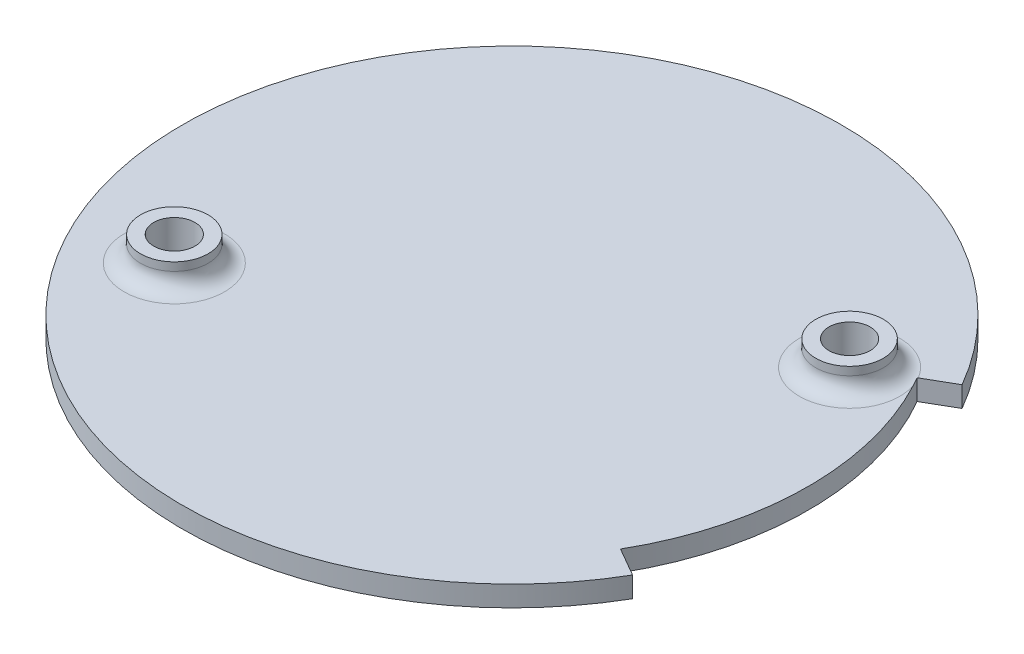
ISO-10303-21;
HEADER;
FILE_DESCRIPTION(('STEP AP214'),'2;1');
FILE_NAME('part.step','',(''),(''),'','','');
FILE_SCHEMA(('AUTOMOTIVE_DESIGN { 1 0 10303 214 1 1 1 1 }'));
ENDSEC;
DATA;
#1=APPLICATION_CONTEXT('core data for automotive mechanical design processes');
#2=APPLICATION_PROTOCOL_DEFINITION('international standard','automotive_design',2000,#1);
#3=PRODUCT_CONTEXT('',#1,'mechanical');
#4=PRODUCT('Part','Part','',(#3));
#5=PRODUCT_RELATED_PRODUCT_CATEGORY('part','',(#4));
#6=PRODUCT_DEFINITION_FORMATION('','',#4);
#7=PRODUCT_DEFINITION_CONTEXT('part definition',#1,'design');
#8=PRODUCT_DEFINITION('design','',#6,#7);
#9=PRODUCT_DEFINITION_SHAPE('','',#8);
#10=(LENGTH_UNIT() NAMED_UNIT(*) SI_UNIT(.MILLI.,.METRE.));
#11=(NAMED_UNIT(*) PLANE_ANGLE_UNIT() SI_UNIT($,.RADIAN.));
#12=(NAMED_UNIT(*) SI_UNIT($,.STERADIAN.) SOLID_ANGLE_UNIT());
#13=UNCERTAINTY_MEASURE_WITH_UNIT(LENGTH_MEASURE(1.E-05),#10,'distance_accuracy_value','');
#14=(GEOMETRIC_REPRESENTATION_CONTEXT(3) GLOBAL_UNCERTAINTY_ASSIGNED_CONTEXT((#13)) GLOBAL_UNIT_ASSIGNED_CONTEXT((#10,
#11,#12)) REPRESENTATION_CONTEXT('',''));
#15=CARTESIAN_POINT('',(0.,0.,0.));
#16=DIRECTION('',(0.,0.,1.));
#17=DIRECTION('',(1.,0.,0.));
#18=AXIS2_PLACEMENT_3D('',#15,#16,#17);
#19=CARTESIAN_POINT('',(0.,15.875,0.));
#20=DIRECTION('',(0.,1.,0.));
#21=DIRECTION('',(0.,0.,1.));
#22=AXIS2_PLACEMENT_3D('',#19,#20,#21);
#23=PLANE('',#22);
#24=CARTESIAN_POINT('',(-32.9955678841872,15.875,19.0499999999999));
#25=DIRECTION('',(0.,-1.,0.));
#26=DIRECTION('',(0.,0.,-1.));
#27=AXIS2_PLACEMENT_3D('',#24,#25,#26);
#28=CIRCLE('',#27,1.65);
#29=CARTESIAN_POINT('',(-32.9955678841872,15.875,17.3999999999999));
#30=VERTEX_POINT('',#29);
#31=EDGE_CURVE('E263',#30,#30,#28,.T.);
#32=ORIENTED_EDGE('',*,*,#31,.F.);
#33=EDGE_LOOP('',(#32));
#34=FACE_BOUND('',#33,.T.);
#35=CARTESIAN_POINT('',(32.9955678841872,15.875,-19.0499999999999));
#36=DIRECTION('',(0.,-1.,0.));
#37=DIRECTION('',(0.,0.,-1.));
#38=AXIS2_PLACEMENT_3D('',#35,#36,#37);
#39=CIRCLE('',#38,1.65);
#40=CARTESIAN_POINT('',(32.9955678841872,15.875,-20.6999999999999));
#41=VERTEX_POINT('',#40);
#42=EDGE_CURVE('E260',#41,#41,#39,.T.);
#43=ORIENTED_EDGE('',*,*,#42,.F.);
#44=EDGE_LOOP('',(#43));
#45=FACE_BOUND('',#44,.T.);
#46=DIRECTION('',(-0.866025403784438,0.,0.500000000000001));
#47=VECTOR('',#46,1.);
#48=CARTESIAN_POINT('',(0.,15.875,0.));
#49=LINE('',#48,#47);
#50=CARTESIAN_POINT('',(43.9940905122494,15.875,-25.4000000000001));
#51=VERTEX_POINT('',#50);
#52=CARTESIAN_POINT('',(39.5946814610245,15.875,-22.86));
#53=VERTEX_POINT('',#52);
#54=EDGE_CURVE('E98',#51,#53,#49,.T.);
#55=ORIENTED_EDGE('',*,*,#54,.T.);
#56=CARTESIAN_POINT('',(0.,15.875,0.));
#57=DIRECTION('',(0.,1.,0.));
#58=DIRECTION('',(0.,0.,1.));
#59=AXIS2_PLACEMENT_3D('',#56,#57,#58);
#60=CIRCLE('',#59,45.72);
#61=CARTESIAN_POINT('',(39.5946814610245,15.875,22.86));
#62=VERTEX_POINT('',#61);
#63=EDGE_CURVE('E99',#53,#62,#60,.F.);
#64=ORIENTED_EDGE('',*,*,#63,.T.);
#65=DIRECTION('',(-0.866025403784438,0.,-0.500000000000001));
#66=VECTOR('',#65,1.);
#67=CARTESIAN_POINT('',(0.,15.875,0.));
#68=LINE('',#67,#66);
#69=CARTESIAN_POINT('',(43.9940905122494,15.875,25.4000000000001));
#70=VERTEX_POINT('',#69);
#71=EDGE_CURVE('E112',#70,#62,#68,.T.);
#72=ORIENTED_EDGE('',*,*,#71,.F.);
#73=CARTESIAN_POINT('',(0.,15.875,0.));
#74=DIRECTION('',(0.,1.,0.));
#75=DIRECTION('',(0.,0.,1.));
#76=AXIS2_PLACEMENT_3D('',#73,#74,#75);
#77=CIRCLE('',#76,50.8);
#78=EDGE_CURVE('E102',#51,#70,#77,.T.);
#79=ORIENTED_EDGE('',*,*,#78,.F.);
#80=EDGE_LOOP('',(#55,#64,#72,#79));
#81=FACE_BOUND('',#80,.T.);
#82=ADVANCED_FACE('F47',(#34,#45,#81),#23,.F.);
#83=CARTESIAN_POINT('',(0.,3.175,0.));
#84=DIRECTION('',(0.,-1.,0.));
#85=DIRECTION('',(0.,0.,-1.));
#86=AXIS2_PLACEMENT_3D('',#83,#84,#85);
#87=CYLINDRICAL_SURFACE('',#86,50.8);
#88=DIRECTION('',(0.,1.,0.));
#89=VECTOR('',#88,1.);
#90=CARTESIAN_POINT('',(43.9940905122494,0.,-25.4000000000001));
#91=LINE('',#90,#89);
#92=CARTESIAN_POINT('',(43.9940905122494,19.05,-25.4000000000001));
#93=VERTEX_POINT('',#92);
#94=EDGE_CURVE('E116',#51,#93,#91,.T.);
#95=ORIENTED_EDGE('',*,*,#94,.F.);
#96=ORIENTED_EDGE('',*,*,#78,.T.);
#97=DIRECTION('',(0.,1.,0.));
#98=VECTOR('',#97,1.);
#99=CARTESIAN_POINT('',(43.9940905122494,0.,25.4000000000001));
#100=LINE('',#99,#98);
#101=CARTESIAN_POINT('',(43.9940905122494,19.05,25.4000000000001));
#102=VERTEX_POINT('',#101);
#103=EDGE_CURVE('E120',#70,#102,#100,.T.);
#104=ORIENTED_EDGE('',*,*,#103,.T.);
#105=CARTESIAN_POINT('',(0.,19.05,0.));
#106=DIRECTION('',(0.,1.,0.));
#107=DIRECTION('',(0.,0.,1.));
#108=AXIS2_PLACEMENT_3D('',#105,#106,#107);
#109=CIRCLE('',#108,50.8);
#110=EDGE_CURVE('E186',#93,#102,#109,.T.);
#111=ORIENTED_EDGE('',*,*,#110,.F.);
#112=EDGE_LOOP('',(#95,#96,#104,#111));
#113=FACE_BOUND('',#112,.T.);
#114=ADVANCED_FACE('F154',(#113),#87,.T.);
#115=CARTESIAN_POINT('',(0.,0.,0.));
#116=DIRECTION('',(-0.500000000000001,0.,0.866025403784438));
#117=DIRECTION('',(0.866025403784438,0.,0.500000000000001));
#118=AXIS2_PLACEMENT_3D('',#115,#116,#117);
#119=PLANE('',#118);
#120=ORIENTED_EDGE('',*,*,#103,.F.);
#121=ORIENTED_EDGE('',*,*,#71,.T.);
#122=DIRECTION('',(0.,1.,0.));
#123=VECTOR('',#122,1.);
#124=CARTESIAN_POINT('',(39.5946814610245,0.,22.86));
#125=LINE('',#124,#123);
#126=CARTESIAN_POINT('',(39.5946814610245,19.05,22.86));
#127=VERTEX_POINT('',#126);
#128=EDGE_CURVE('E111',#62,#127,#125,.T.);
#129=ORIENTED_EDGE('',*,*,#128,.T.);
#130=DIRECTION('',(-0.866025403784438,0.,-0.500000000000001));
#131=VECTOR('',#130,1.);
#132=CARTESIAN_POINT('',(0.,19.05,0.));
#133=LINE('',#132,#131);
#134=EDGE_CURVE('E183',#102,#127,#133,.T.);
#135=ORIENTED_EDGE('',*,*,#134,.F.);
#136=EDGE_LOOP('',(#120,#121,#129,#135));
#137=FACE_BOUND('',#136,.T.);
#138=ADVANCED_FACE('F161',(#137),#119,.F.);
#139=CARTESIAN_POINT('',(0.,0.,0.));
#140=DIRECTION('',(0.,1.,0.));
#141=DIRECTION('',(0.,0.,1.));
#142=AXIS2_PLACEMENT_3D('',#139,#140,#141);
#143=CYLINDRICAL_SURFACE('',#142,45.72);
#144=ORIENTED_EDGE('',*,*,#63,.F.);
#145=DIRECTION('',(0.,1.,0.));
#146=VECTOR('',#145,1.);
#147=CARTESIAN_POINT('',(39.5946814610245,0.,-22.8600000000001));
#148=LINE('',#147,#146);
#149=CARTESIAN_POINT('',(39.5946814610245,19.0531769868593,-22.8600000000001));
#150=VERTEX_POINT('',#149);
#151=EDGE_CURVE('E66',#53,#150,#148,.T.);
#152=ORIENTED_EDGE('',*,*,#151,.T.);
#153=CARTESIAN_POINT('',(39.5946814610245,19.0531769868593,-22.8600000000001));
#154=CARTESIAN_POINT('',(39.6584509865653,19.0531940198967,-22.7495479663954));
#155=CARTESIAN_POINT('',(39.7217581950967,19.0530434085188,-22.6388293044365));
#156=CARTESIAN_POINT('',(39.8474392470708,19.0525347988836,-22.4168742014402));
#157=CARTESIAN_POINT('',(39.9098131557882,19.0521768152002,-22.3056377973336));
#158=CARTESIAN_POINT('',(40.0336277838406,19.0513813297176,-22.0826472645168));
#159=CARTESIAN_POINT('',(40.0950685040283,19.0509438279912,-21.9708931362797));
#160=CARTESIAN_POINT('',(40.2170171736378,19.0502604060662,-21.746866345461));
#161=CARTESIAN_POINT('',(40.277525056747,19.0500144994265,-21.6345936467463));
#162=CARTESIAN_POINT('',(40.3375623533858,19.05,-21.5220692171247));
#163=B_SPLINE_CURVE_WITH_KNOTS('',3,(#153,#154,#155,#156,#157,#158,#159,#160,#161,#162),
.UNSPECIFIED.,.F.,.F.,(4,2,2,2,4),(0.,0.382615476870098,0.765204067465549,1.14779230850627,
1.53040762235897),.UNSPECIFIED.);
#164=CARTESIAN_POINT('',(40.3375623533858,19.05,-21.5220692171247));
#165=VERTEX_POINT('',#164);
#166=EDGE_CURVE('E11',#150,#165,#163,.T.);
#167=ORIENTED_EDGE('',*,*,#166,.T.);
#168=CARTESIAN_POINT('',(0.,19.05,0.));
#169=DIRECTION('',(0.,1.,0.));
#170=DIRECTION('',(0.,0.,1.));
#171=AXIS2_PLACEMENT_3D('',#168,#169,#170);
#172=CIRCLE('',#171,45.72);
#173=EDGE_CURVE('E192',#127,#165,#172,.T.);
#174=ORIENTED_EDGE('',*,*,#173,.F.);
#175=ORIENTED_EDGE('',*,*,#128,.F.);
#176=EDGE_LOOP('',(#144,#152,#167,#174,#175));
#177=FACE_BOUND('',#176,.T.);
#178=ADVANCED_FACE('F109',(#177),#143,.T.);
#179=CARTESIAN_POINT('',(0.,0.,0.));
#180=DIRECTION('',(0.500000000000001,0.,0.866025403784438));
#181=DIRECTION('',(0.866025403784438,0.,-0.500000000000001));
#182=AXIS2_PLACEMENT_3D('',#179,#180,#181);
#183=PLANE('',#182);
#184=ORIENTED_EDGE('',*,*,#54,.F.);
#185=ORIENTED_EDGE('',*,*,#94,.T.);
#186=DIRECTION('',(0.866025403784438,0.,-0.500000000000001));
#187=VECTOR('',#186,1.);
#188=CARTESIAN_POINT('',(0.,19.05,0.));
#189=LINE('',#188,#187);
#190=CARTESIAN_POINT('',(39.7046666873051,19.05,-22.9235000000001));
#191=VERTEX_POINT('',#190);
#192=EDGE_CURVE('E125',#191,#93,#189,.T.);
#193=ORIENTED_EDGE('',*,*,#192,.F.);
#194=CARTESIAN_POINT('',(39.7046666873052,21.59,-22.9234999999999));
#195=DIRECTION('',(0.500000000000001,0.,0.866025403784438));
#196=DIRECTION('',(0.866025403784438,0.,-0.500000000000001));
#197=AXIS2_PLACEMENT_3D('',#194,#195,#196);
#198=CIRCLE('',#197,2.54);
#199=EDGE_CURVE('E60',#191,#150,#198,.F.);
#200=ORIENTED_EDGE('',*,*,#199,.T.);
#201=ORIENTED_EDGE('',*,*,#151,.F.);
#202=EDGE_LOOP('',(#184,#185,#193,#200,#201));
#203=FACE_BOUND('',#202,.T.);
#204=ADVANCED_FACE('F114',(#203),#183,.T.);
#205=CARTESIAN_POINT('',(0.,19.05,0.));
#206=DIRECTION('',(0.,1.,0.));
#207=DIRECTION('',(0.,0.,1.));
#208=AXIS2_PLACEMENT_3D('',#205,#206,#207);
#209=PLANE('',#208);
#210=CARTESIAN_POINT('',(-32.9955678841872,19.05,19.0499999999999));
#211=DIRECTION('',(0.,1.,0.));
#212=DIRECTION('',(0.,0.,1.));
#213=AXIS2_PLACEMENT_3D('',#210,#211,#212);
#214=CIRCLE('',#213,7.747);
#215=CARTESIAN_POINT('',(-32.9955678841872,19.05,26.7969999999999));
#216=VERTEX_POINT('',#215);
#217=EDGE_CURVE('E128',#216,#216,#214,.F.);
#218=ORIENTED_EDGE('',*,*,#217,.T.);
#219=EDGE_LOOP('',(#218));
#220=FACE_BOUND('',#219,.T.);
#221=ORIENTED_EDGE('',*,*,#173,.T.);
#222=CARTESIAN_POINT('',(32.9955678841872,19.05,-19.0499999999999));
#223=DIRECTION('',(0.,1.,0.));
#224=DIRECTION('',(0.,0.,1.));
#225=AXIS2_PLACEMENT_3D('',#222,#223,#224);
#226=CIRCLE('',#225,7.747);
#227=EDGE_CURVE('E131',#165,#191,#226,.F.);
#228=ORIENTED_EDGE('',*,*,#227,.T.);
#229=ORIENTED_EDGE('',*,*,#192,.T.);
#230=ORIENTED_EDGE('',*,*,#110,.T.);
#231=ORIENTED_EDGE('',*,*,#134,.T.);
#232=EDGE_LOOP('',(#221,#228,#229,#230,#231));
#233=FACE_BOUND('',#232,.T.);
#234=ADVANCED_FACE('F167',(#220,#233),#209,.T.);
#235=CARTESIAN_POINT('',(32.9955678841872,17.78,-19.0499999999999));
#236=DIRECTION('',(0.,1.,0.));
#237=DIRECTION('',(0.,0.,1.));
#238=AXIS2_PLACEMENT_3D('',#235,#236,#237);
#239=PLANE('',#238);
#240=CARTESIAN_POINT('',(32.9955678841872,17.78,-19.0499999999999));
#241=DIRECTION('',(0.,1.,0.));
#242=DIRECTION('',(0.,0.,1.));
#243=AXIS2_PLACEMENT_3D('',#240,#241,#242);
#244=CIRCLE('',#243,1.65);
#245=CARTESIAN_POINT('',(32.9955678841872,17.78,-17.3999999999999));
#246=VERTEX_POINT('',#245);
#247=EDGE_CURVE('E258',#246,#246,#244,.F.);
#248=ORIENTED_EDGE('',*,*,#247,.T.);
#249=EDGE_LOOP('',(#248));
#250=FACE_BOUND('',#249,.T.);
#251=CARTESIAN_POINT('',(32.9955678841872,17.78,-19.0499999999999));
#252=DIRECTION('',(0.,1.,0.));
#253=DIRECTION('',(0.,0.,1.));
#254=AXIS2_PLACEMENT_3D('',#251,#252,#253);
#255=CIRCLE('',#254,3.175);
#256=CARTESIAN_POINT('',(32.9955678841872,17.78,-15.8749999999999));
#257=VERTEX_POINT('',#256);
#258=EDGE_CURVE('E220',#257,#257,#255,.T.);
#259=ORIENTED_EDGE('',*,*,#258,.T.);
#260=EDGE_LOOP('',(#259));
#261=FACE_BOUND('',#260,.T.);
#262=ADVANCED_FACE('F226',(#250,#261),#239,.T.);
#263=CARTESIAN_POINT('',(32.9955678841872,17.78,-19.0499999999999));
#264=DIRECTION('',(0.,1.,0.));
#265=DIRECTION('',(0.,0.,1.));
#266=AXIS2_PLACEMENT_3D('',#263,#264,#265);
#267=CYLINDRICAL_SURFACE('',#266,3.175);
#268=ORIENTED_EDGE('',*,*,#258,.F.);
#269=EDGE_LOOP('',(#268));
#270=FACE_BOUND('',#269,.T.);
#271=CARTESIAN_POINT('',(32.9955678841872,22.86,-19.0499999999999));
#272=DIRECTION('',(0.,1.,0.));
#273=DIRECTION('',(0.,0.,1.));
#274=AXIS2_PLACEMENT_3D('',#271,#272,#273);
#275=CIRCLE('',#274,3.175);
#276=CARTESIAN_POINT('',(32.9955678841872,22.86,-15.8749999999999));
#277=VERTEX_POINT('',#276);
#278=EDGE_CURVE('E208',#277,#277,#275,.F.);
#279=ORIENTED_EDGE('',*,*,#278,.F.);
#280=EDGE_LOOP('',(#279));
#281=FACE_BOUND('',#280,.T.);
#282=ADVANCED_FACE('F228',(#270,#281),#267,.F.);
#283=CARTESIAN_POINT('',(-32.9955678841872,17.78,19.0499999999999));
#284=DIRECTION('',(0.,1.,0.));
#285=DIRECTION('',(0.,0.,1.));
#286=AXIS2_PLACEMENT_3D('',#283,#284,#285);
#287=PLANE('',#286);
#288=CARTESIAN_POINT('',(-32.9955678841872,17.78,19.0499999999999));
#289=DIRECTION('',(0.,1.,0.));
#290=DIRECTION('',(0.,0.,1.));
#291=AXIS2_PLACEMENT_3D('',#288,#289,#290);
#292=CIRCLE('',#291,1.65);
#293=CARTESIAN_POINT('',(-32.9955678841872,17.78,20.6999999999999));
#294=VERTEX_POINT('',#293);
#295=EDGE_CURVE('E214',#294,#294,#292,.F.);
#296=ORIENTED_EDGE('',*,*,#295,.T.);
#297=EDGE_LOOP('',(#296));
#298=FACE_BOUND('',#297,.T.);
#299=CARTESIAN_POINT('',(-32.9955678841872,17.78,19.0499999999999));
#300=DIRECTION('',(0.,1.,0.));
#301=DIRECTION('',(0.,0.,1.));
#302=AXIS2_PLACEMENT_3D('',#299,#300,#301);
#303=CIRCLE('',#302,3.175);
#304=CARTESIAN_POINT('',(-32.9955678841872,17.78,22.2249999999999));
#305=VERTEX_POINT('',#304);
#306=EDGE_CURVE('E106',#305,#305,#303,.T.);
#307=ORIENTED_EDGE('',*,*,#306,.T.);
#308=EDGE_LOOP('',(#307));
#309=FACE_BOUND('',#308,.T.);
#310=ADVANCED_FACE('F230',(#298,#309),#287,.T.);
#311=CARTESIAN_POINT('',(-32.9955678841872,17.78,19.0499999999999));
#312=DIRECTION('',(0.,1.,0.));
#313=DIRECTION('',(0.,0.,1.));
#314=AXIS2_PLACEMENT_3D('',#311,#312,#313);
#315=CYLINDRICAL_SURFACE('',#314,3.175);
#316=ORIENTED_EDGE('',*,*,#306,.F.);
#317=EDGE_LOOP('',(#316));
#318=FACE_BOUND('',#317,.T.);
#319=CARTESIAN_POINT('',(-32.9955678841872,22.86,19.0499999999999));
#320=DIRECTION('',(0.,1.,0.));
#321=DIRECTION('',(0.,0.,1.));
#322=AXIS2_PLACEMENT_3D('',#319,#320,#321);
#323=CIRCLE('',#322,3.175);
#324=CARTESIAN_POINT('',(-32.9955678841872,22.86,22.2249999999999));
#325=VERTEX_POINT('',#324);
#326=EDGE_CURVE('E207',#325,#325,#323,.F.);
#327=ORIENTED_EDGE('',*,*,#326,.F.);
#328=EDGE_LOOP('',(#327));
#329=FACE_BOUND('',#328,.T.);
#330=ADVANCED_FACE('F245',(#318,#329),#315,.F.);
#331=CARTESIAN_POINT('',(-32.9955678841872,22.86,19.0499999999999));
#332=DIRECTION('',(0.,-1.,0.));
#333=DIRECTION('',(0.,0.,-1.));
#334=AXIS2_PLACEMENT_3D('',#331,#332,#333);
#335=CYLINDRICAL_SURFACE('',#334,5.207);
#336=CARTESIAN_POINT('',(-32.9955678841872,21.59,19.0499999999999));
#337=DIRECTION('',(0.,1.,0.));
#338=DIRECTION('',(0.,0.,1.));
#339=AXIS2_PLACEMENT_3D('',#336,#337,#338);
#340=CIRCLE('',#339,5.207);
#341=CARTESIAN_POINT('',(-32.9955678841872,21.59,13.8429999999999));
#342=VERTEX_POINT('',#341);
#343=EDGE_CURVE('E133',#342,#342,#340,.T.);
#344=CARTESIAN_POINT('',(-32.9955678841872,22.86,19.0499999999999));
#345=DIRECTION('',(0.,1.,0.));
#346=DIRECTION('',(0.,0.,1.));
#347=AXIS2_PLACEMENT_3D('',#344,#345,#346);
#348=CIRCLE('',#347,5.207);
#349=CARTESIAN_POINT('',(-32.9955678841872,22.86,13.8429999999999));
#350=VERTEX_POINT('',#349);
#351=EDGE_CURVE('E211',#350,#350,#348,.T.);
#352=CARTESIAN_POINT('',(-32.9955678841872,21.59,13.8429999999999));
#353=CARTESIAN_POINT('',(-32.9955678841872,21.6032291666667,13.8429999999999));
#354=CARTESIAN_POINT('',(-32.9955678841872,21.6164583333333,13.8429999999999));
#355=CARTESIAN_POINT('',(-32.9955678841872,21.6429166666667,13.8429999999999));
#356=CARTESIAN_POINT('',(-32.9955678841872,21.6561458333333,13.8429999999999));
#357=CARTESIAN_POINT('',(-32.9955678841872,21.6826041666667,13.8429999999999));
#358=CARTESIAN_POINT('',(-32.9955678841872,21.6958333333333,13.8429999999999));
#359=CARTESIAN_POINT('',(-32.9955678841872,21.7222916666667,13.8429999999999));
#360=CARTESIAN_POINT('',(-32.9955678841872,21.7355208333333,13.8429999999999));
#361=CARTESIAN_POINT('',(-32.9955678841872,21.7619791666667,13.8429999999999));
#362=CARTESIAN_POINT('',(-32.9955678841872,21.7752083333333,13.8429999999999));
#363=CARTESIAN_POINT('',(-32.9955678841872,21.8016666666667,13.8429999999999));
#364=CARTESIAN_POINT('',(-32.9955678841872,21.8148958333333,13.8429999999999));
#365=CARTESIAN_POINT('',(-32.9955678841872,21.8413541666667,13.8429999999999));
#366=CARTESIAN_POINT('',(-32.9955678841872,21.8545833333333,13.8429999999999));
#367=CARTESIAN_POINT('',(-32.9955678841872,21.8810416666667,13.8429999999999));
#368=CARTESIAN_POINT('',(-32.9955678841872,21.8942708333333,13.8429999999999));
#369=CARTESIAN_POINT('',(-32.9955678841872,21.9207291666667,13.8429999999999));
#370=CARTESIAN_POINT('',(-32.9955678841872,21.9339583333333,13.8429999999999));
#371=CARTESIAN_POINT('',(-32.9955678841872,21.9604166666667,13.8429999999999));
#372=CARTESIAN_POINT('',(-32.9955678841872,21.9736458333333,13.8429999999999));
#373=CARTESIAN_POINT('',(-32.9955678841872,22.0001041666667,13.8429999999999));
#374=CARTESIAN_POINT('',(-32.9955678841872,22.0133333333333,13.8429999999999));
#375=CARTESIAN_POINT('',(-32.9955678841872,22.0397916666667,13.8429999999999));
#376=CARTESIAN_POINT('',(-32.9955678841872,22.0530208333333,13.8429999999999));
#377=CARTESIAN_POINT('',(-32.9955678841872,22.0794791666667,13.8429999999999));
#378=CARTESIAN_POINT('',(-32.9955678841872,22.0927083333333,13.8429999999999));
#379=CARTESIAN_POINT('',(-32.9955678841872,22.1191666666667,13.8429999999999));
#380=CARTESIAN_POINT('',(-32.9955678841872,22.1323958333333,13.8429999999999));
#381=CARTESIAN_POINT('',(-32.9955678841872,22.1588541666667,13.8429999999999));
#382=CARTESIAN_POINT('',(-32.9955678841872,22.1720833333333,13.8429999999999));
#383=CARTESIAN_POINT('',(-32.9955678841872,22.1985416666667,13.8429999999999));
#384=CARTESIAN_POINT('',(-32.9955678841872,22.2117708333333,13.8429999999999));
#385=CARTESIAN_POINT('',(-32.9955678841872,22.2382291666667,13.8429999999999));
#386=CARTESIAN_POINT('',(-32.9955678841872,22.2514583333333,13.8429999999999));
#387=CARTESIAN_POINT('',(-32.9955678841872,22.2779166666667,13.8429999999999));
#388=CARTESIAN_POINT('',(-32.9955678841872,22.2911458333333,13.8429999999999));
#389=CARTESIAN_POINT('',(-32.9955678841872,22.3176041666667,13.8429999999999));
#390=CARTESIAN_POINT('',(-32.9955678841872,22.3308333333333,13.8429999999999));
#391=CARTESIAN_POINT('',(-32.9955678841872,22.3572916666667,13.8429999999999));
#392=CARTESIAN_POINT('',(-32.9955678841872,22.3705208333333,13.8429999999999));
#393=CARTESIAN_POINT('',(-32.9955678841872,22.3969791666667,13.8429999999999));
#394=CARTESIAN_POINT('',(-32.9955678841872,22.4102083333333,13.8429999999999));
#395=CARTESIAN_POINT('',(-32.9955678841872,22.4366666666667,13.8429999999999));
#396=CARTESIAN_POINT('',(-32.9955678841872,22.4498958333333,13.8429999999999));
#397=CARTESIAN_POINT('',(-32.9955678841872,22.4763541666667,13.8429999999999));
#398=CARTESIAN_POINT('',(-32.9955678841872,22.4895833333333,13.8429999999999));
#399=CARTESIAN_POINT('',(-32.9955678841872,22.5160416666667,13.8429999999999));
#400=CARTESIAN_POINT('',(-32.9955678841872,22.5292708333333,13.8429999999999));
#401=CARTESIAN_POINT('',(-32.9955678841872,22.5557291666667,13.8429999999999));
#402=CARTESIAN_POINT('',(-32.9955678841872,22.5689583333333,13.8429999999999));
#403=CARTESIAN_POINT('',(-32.9955678841872,22.5954166666667,13.8429999999999));
#404=CARTESIAN_POINT('',(-32.9955678841872,22.6086458333333,13.8429999999999));
#405=CARTESIAN_POINT('',(-32.9955678841872,22.6351041666667,13.8429999999999));
#406=CARTESIAN_POINT('',(-32.9955678841872,22.6483333333333,13.8429999999999));
#407=CARTESIAN_POINT('',(-32.9955678841872,22.6747916666667,13.8429999999999));
#408=CARTESIAN_POINT('',(-32.9955678841872,22.6880208333333,13.8429999999999));
#409=CARTESIAN_POINT('',(-32.9955678841872,22.7144791666667,13.8429999999999));
#410=CARTESIAN_POINT('',(-32.9955678841872,22.7277083333333,13.8429999999999));
#411=CARTESIAN_POINT('',(-32.9955678841872,22.7541666666667,13.8429999999999));
#412=CARTESIAN_POINT('',(-32.9955678841872,22.7673958333333,13.8429999999999));
#413=CARTESIAN_POINT('',(-32.9955678841872,22.7938541666667,13.8429999999999));
#414=CARTESIAN_POINT('',(-32.9955678841872,22.8070833333333,13.8429999999999));
#415=CARTESIAN_POINT('',(-32.9955678841872,22.8335416666667,13.8429999999999));
#416=CARTESIAN_POINT('',(-32.9955678841872,22.8467708333333,13.8429999999999));
#417=CARTESIAN_POINT('',(-32.9955678841872,22.86,13.8429999999999));
#418=B_SPLINE_CURVE_WITH_KNOTS('',3,(#352,#353,#354,#355,#356,#357,#358,#359,#360,#361,#362,
#363,#364,#365,#366,#367,#368,#369,#370,#371,#372,#373,#374,#375,#376,#377,#378,#379,#380,#381,
#382,#383,#384,#385,#386,#387,#388,#389,#390,#391,#392,#393,#394,#395,#396,#397,#398,#399,#400,
#401,#402,#403,#404,#405,#406,#407,#408,#409,#410,#411,#412,#413,#414,#415,#416,#417),
.UNSPECIFIED.,.F.,.F.,(4,2,2,2,2,2,2,2,2,2,2,2,2,2,2,2,2,2,2,2,2,2,2,2,2,2,2,2,2,2,2,2,4),(0.,
0.0396874999999998,0.0793749999999996,0.119062499999999,0.158749999999999,0.198437499999999,
0.238124999999999,0.277812499999999,0.317499999999998,0.357187499999998,0.396874999999998,
0.436562499999998,0.476249999999998,0.515937499999997,0.555624999999997,0.595312499999997,0.635,
0.6746875,0.714375,0.7540625,0.793749999999999,0.833437499999999,0.873124999999999,
0.912812499999999,0.952499999999998,0.992187499999998,1.031875,1.0715625,1.11125,1.1509375,
1.190625,1.2303125,1.27),.UNSPECIFIED.);
#419=EDGE_CURVE('BSEAM137',#342,#350,#418,.T.);
#420=ORIENTED_EDGE('',*,*,#343,.T.);
#421=ORIENTED_EDGE('',*,*,#351,.F.);
#422=ORIENTED_EDGE('',*,*,#419,.T.);
#423=ORIENTED_EDGE('',*,*,#419,.F.);
#424=EDGE_LOOP('',(#420,#422,#421,#423));
#425=FACE_BOUND('',#424,.T.);
#426=ADVANCED_FACE('F137',(#425),#335,.T.);
#427=CARTESIAN_POINT('',(0.,22.86,0.));
#428=DIRECTION('',(0.,1.,0.));
#429=DIRECTION('',(0.,0.,1.));
#430=AXIS2_PLACEMENT_3D('',#427,#428,#429);
#431=PLANE('',#430);
#432=ORIENTED_EDGE('',*,*,#326,.T.);
#433=EDGE_LOOP('',(#432));
#434=FACE_BOUND('',#433,.T.);
#435=ORIENTED_EDGE('',*,*,#351,.T.);
#436=EDGE_LOOP('',(#435));
#437=FACE_BOUND('',#436,.T.);
#438=ADVANCED_FACE('F201',(#434,#437),#431,.T.);
#439=CARTESIAN_POINT('',(32.9955678841872,22.86,-19.0499999999999));
#440=DIRECTION('',(0.,-1.,0.));
#441=DIRECTION('',(0.,0.,-1.));
#442=AXIS2_PLACEMENT_3D('',#439,#440,#441);
#443=CYLINDRICAL_SURFACE('',#442,5.207);
#444=CARTESIAN_POINT('',(32.9955678841872,21.59,-19.0499999999999));
#445=DIRECTION('',(0.,1.,0.));
#446=DIRECTION('',(0.,0.,1.));
#447=AXIS2_PLACEMENT_3D('',#444,#445,#446);
#448=CIRCLE('',#447,5.207);
#449=CARTESIAN_POINT('',(32.9955678841872,21.59,-24.2569999999999));
#450=VERTEX_POINT('',#449);
#451=EDGE_CURVE('E118',#450,#450,#448,.T.);
#452=CARTESIAN_POINT('',(32.9955678841872,22.86,-19.0499999999999));
#453=DIRECTION('',(0.,1.,0.));
#454=DIRECTION('',(0.,0.,1.));
#455=AXIS2_PLACEMENT_3D('',#452,#453,#454);
#456=CIRCLE('',#455,5.207);
#457=CARTESIAN_POINT('',(32.9955678841872,22.86,-24.2569999999999));
#458=VERTEX_POINT('',#457);
#459=EDGE_CURVE('E205',#458,#458,#456,.T.);
#460=CARTESIAN_POINT('',(32.9955678841872,21.59,-24.2569999999999));
#461=CARTESIAN_POINT('',(32.9955678841872,21.6032291666667,-24.2569999999999));
#462=CARTESIAN_POINT('',(32.9955678841872,21.6164583333333,-24.2569999999999));
#463=CARTESIAN_POINT('',(32.9955678841872,21.6429166666667,-24.2569999999999));
#464=CARTESIAN_POINT('',(32.9955678841872,21.6561458333333,-24.2569999999999));
#465=CARTESIAN_POINT('',(32.9955678841872,21.6826041666667,-24.2569999999999));
#466=CARTESIAN_POINT('',(32.9955678841872,21.6958333333333,-24.2569999999999));
#467=CARTESIAN_POINT('',(32.9955678841872,21.7222916666667,-24.2569999999999));
#468=CARTESIAN_POINT('',(32.9955678841872,21.7355208333333,-24.2569999999999));
#469=CARTESIAN_POINT('',(32.9955678841872,21.7619791666667,-24.2569999999999));
#470=CARTESIAN_POINT('',(32.9955678841872,21.7752083333333,-24.2569999999999));
#471=CARTESIAN_POINT('',(32.9955678841872,21.8016666666667,-24.2569999999999));
#472=CARTESIAN_POINT('',(32.9955678841872,21.8148958333333,-24.2569999999999));
#473=CARTESIAN_POINT('',(32.9955678841872,21.8413541666667,-24.2569999999999));
#474=CARTESIAN_POINT('',(32.9955678841872,21.8545833333333,-24.2569999999999));
#475=CARTESIAN_POINT('',(32.9955678841872,21.8810416666667,-24.2569999999999));
#476=CARTESIAN_POINT('',(32.9955678841872,21.8942708333333,-24.2569999999999));
#477=CARTESIAN_POINT('',(32.9955678841872,21.9207291666667,-24.2569999999999));
#478=CARTESIAN_POINT('',(32.9955678841872,21.9339583333333,-24.2569999999999));
#479=CARTESIAN_POINT('',(32.9955678841872,21.9604166666667,-24.2569999999999));
#480=CARTESIAN_POINT('',(32.9955678841872,21.9736458333333,-24.2569999999999));
#481=CARTESIAN_POINT('',(32.9955678841872,22.0001041666667,-24.2569999999999));
#482=CARTESIAN_POINT('',(32.9955678841872,22.0133333333333,-24.2569999999999));
#483=CARTESIAN_POINT('',(32.9955678841872,22.0397916666667,-24.2569999999999));
#484=CARTESIAN_POINT('',(32.9955678841872,22.0530208333333,-24.2569999999999));
#485=CARTESIAN_POINT('',(32.9955678841872,22.0794791666667,-24.2569999999999));
#486=CARTESIAN_POINT('',(32.9955678841872,22.0927083333333,-24.2569999999999));
#487=CARTESIAN_POINT('',(32.9955678841872,22.1191666666667,-24.2569999999999));
#488=CARTESIAN_POINT('',(32.9955678841872,22.1323958333333,-24.2569999999999));
#489=CARTESIAN_POINT('',(32.9955678841872,22.1588541666667,-24.2569999999999));
#490=CARTESIAN_POINT('',(32.9955678841872,22.1720833333333,-24.2569999999999));
#491=CARTESIAN_POINT('',(32.9955678841872,22.1985416666667,-24.2569999999999));
#492=CARTESIAN_POINT('',(32.9955678841872,22.2117708333333,-24.2569999999999));
#493=CARTESIAN_POINT('',(32.9955678841872,22.2382291666667,-24.2569999999999));
#494=CARTESIAN_POINT('',(32.9955678841872,22.2514583333333,-24.2569999999999));
#495=CARTESIAN_POINT('',(32.9955678841872,22.2779166666667,-24.2569999999999));
#496=CARTESIAN_POINT('',(32.9955678841872,22.2911458333333,-24.2569999999999));
#497=CARTESIAN_POINT('',(32.9955678841872,22.3176041666667,-24.2569999999999));
#498=CARTESIAN_POINT('',(32.9955678841872,22.3308333333333,-24.2569999999999));
#499=CARTESIAN_POINT('',(32.9955678841872,22.3572916666667,-24.2569999999999));
#500=CARTESIAN_POINT('',(32.9955678841872,22.3705208333333,-24.2569999999999));
#501=CARTESIAN_POINT('',(32.9955678841872,22.3969791666667,-24.2569999999999));
#502=CARTESIAN_POINT('',(32.9955678841872,22.4102083333333,-24.2569999999999));
#503=CARTESIAN_POINT('',(32.9955678841872,22.4366666666667,-24.2569999999999));
#504=CARTESIAN_POINT('',(32.9955678841872,22.4498958333333,-24.2569999999999));
#505=CARTESIAN_POINT('',(32.9955678841872,22.4763541666667,-24.2569999999999));
#506=CARTESIAN_POINT('',(32.9955678841872,22.4895833333333,-24.2569999999999));
#507=CARTESIAN_POINT('',(32.9955678841872,22.5160416666667,-24.2569999999999));
#508=CARTESIAN_POINT('',(32.9955678841872,22.5292708333333,-24.2569999999999));
#509=CARTESIAN_POINT('',(32.9955678841872,22.5557291666667,-24.2569999999999));
#510=CARTESIAN_POINT('',(32.9955678841872,22.5689583333333,-24.2569999999999));
#511=CARTESIAN_POINT('',(32.9955678841872,22.5954166666667,-24.2569999999999));
#512=CARTESIAN_POINT('',(32.9955678841872,22.6086458333333,-24.2569999999999));
#513=CARTESIAN_POINT('',(32.9955678841872,22.6351041666667,-24.2569999999999));
#514=CARTESIAN_POINT('',(32.9955678841872,22.6483333333333,-24.2569999999999));
#515=CARTESIAN_POINT('',(32.9955678841872,22.6747916666667,-24.2569999999999));
#516=CARTESIAN_POINT('',(32.9955678841872,22.6880208333333,-24.2569999999999));
#517=CARTESIAN_POINT('',(32.9955678841872,22.7144791666667,-24.2569999999999));
#518=CARTESIAN_POINT('',(32.9955678841872,22.7277083333333,-24.2569999999999));
#519=CARTESIAN_POINT('',(32.9955678841872,22.7541666666667,-24.2569999999999));
#520=CARTESIAN_POINT('',(32.9955678841872,22.7673958333333,-24.2569999999999));
#521=CARTESIAN_POINT('',(32.9955678841872,22.7938541666667,-24.2569999999999));
#522=CARTESIAN_POINT('',(32.9955678841872,22.8070833333333,-24.2569999999999));
#523=CARTESIAN_POINT('',(32.9955678841872,22.8335416666667,-24.2569999999999));
#524=CARTESIAN_POINT('',(32.9955678841872,22.8467708333333,-24.2569999999999));
#525=CARTESIAN_POINT('',(32.9955678841872,22.86,-24.2569999999999));
#526=B_SPLINE_CURVE_WITH_KNOTS('',3,(#460,#461,#462,#463,#464,#465,#466,#467,#468,#469,#470,
#471,#472,#473,#474,#475,#476,#477,#478,#479,#480,#481,#482,#483,#484,#485,#486,#487,#488,#489,
#490,#491,#492,#493,#494,#495,#496,#497,#498,#499,#500,#501,#502,#503,#504,#505,#506,#507,#508,
#509,#510,#511,#512,#513,#514,#515,#516,#517,#518,#519,#520,#521,#522,#523,#524,#525),
.UNSPECIFIED.,.F.,.F.,(4,2,2,2,2,2,2,2,2,2,2,2,2,2,2,2,2,2,2,2,2,2,2,2,2,2,2,2,2,2,2,2,4),(0.,
0.0396874999999998,0.0793749999999996,0.119062499999999,0.158749999999999,0.198437499999999,
0.238124999999999,0.277812499999999,0.317499999999998,0.357187499999998,0.396874999999998,
0.436562499999998,0.476249999999998,0.515937499999997,0.555624999999997,0.595312499999997,0.635,
0.6746875,0.714375,0.7540625,0.793749999999999,0.833437499999999,0.873124999999999,
0.912812499999999,0.952499999999998,0.992187499999998,1.031875,1.0715625,1.11125,1.1509375,
1.190625,1.2303125,1.27),.UNSPECIFIED.);
#527=EDGE_CURVE('BSEAM198',#450,#458,#526,.T.);
#528=ORIENTED_EDGE('',*,*,#451,.T.);
#529=ORIENTED_EDGE('',*,*,#459,.F.);
#530=ORIENTED_EDGE('',*,*,#527,.T.);
#531=ORIENTED_EDGE('',*,*,#527,.F.);
#532=EDGE_LOOP('',(#528,#530,#529,#531));
#533=FACE_BOUND('',#532,.T.);
#534=ADVANCED_FACE('F198',(#533),#443,.T.);
#535=CARTESIAN_POINT('',(0.,22.86,0.));
#536=DIRECTION('',(0.,1.,0.));
#537=DIRECTION('',(0.,0.,1.));
#538=AXIS2_PLACEMENT_3D('',#535,#536,#537);
#539=PLANE('',#538);
#540=ORIENTED_EDGE('',*,*,#278,.T.);
#541=EDGE_LOOP('',(#540));
#542=FACE_BOUND('',#541,.T.);
#543=ORIENTED_EDGE('',*,*,#459,.T.);
#544=EDGE_LOOP('',(#543));
#545=FACE_BOUND('',#544,.T.);
#546=ADVANCED_FACE('F152',(#542,#545),#539,.T.);
#547=CARTESIAN_POINT('',(32.9955678841872,21.59,-19.0499999999999));
#548=DIRECTION('',(0.,1.,0.));
#549=DIRECTION('',(0.,0.,1.));
#550=AXIS2_PLACEMENT_3D('',#547,#548,#549);
#551=TOROIDAL_SURFACE('',#550,7.747,2.54);
#552=ORIENTED_EDGE('',*,*,#199,.F.);
#553=ORIENTED_EDGE('',*,*,#227,.F.);
#554=ORIENTED_EDGE('',*,*,#166,.F.);
#555=EDGE_LOOP('',(#552,#553,#554));
#556=FACE_BOUND('',#555,.T.);
#557=ORIENTED_EDGE('',*,*,#451,.F.);
#558=EDGE_LOOP('',(#557));
#559=FACE_BOUND('',#558,.T.);
#560=ADVANCED_FACE('F142',(#556,#559),#551,.F.);
#561=CARTESIAN_POINT('',(-32.9955678841872,21.59,19.0499999999999));
#562=DIRECTION('',(0.,1.,0.));
#563=DIRECTION('',(0.,0.,1.));
#564=AXIS2_PLACEMENT_3D('',#561,#562,#563);
#565=TOROIDAL_SURFACE('',#564,7.747,2.54);
#566=ORIENTED_EDGE('',*,*,#217,.F.);
#567=EDGE_LOOP('',(#566));
#568=FACE_BOUND('',#567,.T.);
#569=ORIENTED_EDGE('',*,*,#343,.F.);
#570=EDGE_LOOP('',(#569));
#571=FACE_BOUND('',#570,.T.);
#572=ADVANCED_FACE('F49',(#568,#571),#565,.F.);
#573=CARTESIAN_POINT('',(-32.9955678841872,22.4469047558312,19.0499999999999));
#574=DIRECTION('',(0.,-1.,0.));
#575=DIRECTION('',(0.,0.,-1.));
#576=AXIS2_PLACEMENT_3D('',#573,#574,#575);
#577=CYLINDRICAL_SURFACE('',#576,1.65);
#578=ORIENTED_EDGE('',*,*,#31,.T.);
#579=EDGE_LOOP('',(#578));
#580=FACE_BOUND('',#579,.T.);
#581=ORIENTED_EDGE('',*,*,#295,.F.);
#582=EDGE_LOOP('',(#581));
#583=FACE_BOUND('',#582,.T.);
#584=ADVANCED_FACE('F141',(#580,#583),#577,.F.);
#585=CARTESIAN_POINT('',(32.9955678841872,22.4469047558312,-19.0499999999999));
#586=DIRECTION('',(0.,-1.,0.));
#587=DIRECTION('',(0.,0.,-1.));
#588=AXIS2_PLACEMENT_3D('',#585,#586,#587);
#589=CYLINDRICAL_SURFACE('',#588,1.65);
#590=ORIENTED_EDGE('',*,*,#42,.T.);
#591=EDGE_LOOP('',(#590));
#592=FACE_BOUND('',#591,.T.);
#593=ORIENTED_EDGE('',*,*,#247,.F.);
#594=EDGE_LOOP('',(#593));
#595=FACE_BOUND('',#594,.T.);
#596=ADVANCED_FACE('F149',(#592,#595),#589,.F.);
#597=CLOSED_SHELL('',(#82,#114,#138,#178,#204,#234,#262,#282,#310,#330,#426,#438,#534,#546,#560,
#572,#584,#596));
#598=MANIFOLD_SOLID_BREP('B2',#597);
#599=ADVANCED_BREP_SHAPE_REPRESENTATION('',(#18,#598),#14);
#600=SHAPE_DEFINITION_REPRESENTATION(#9,#599);
ENDSEC;
END-ISO-10303-21;
